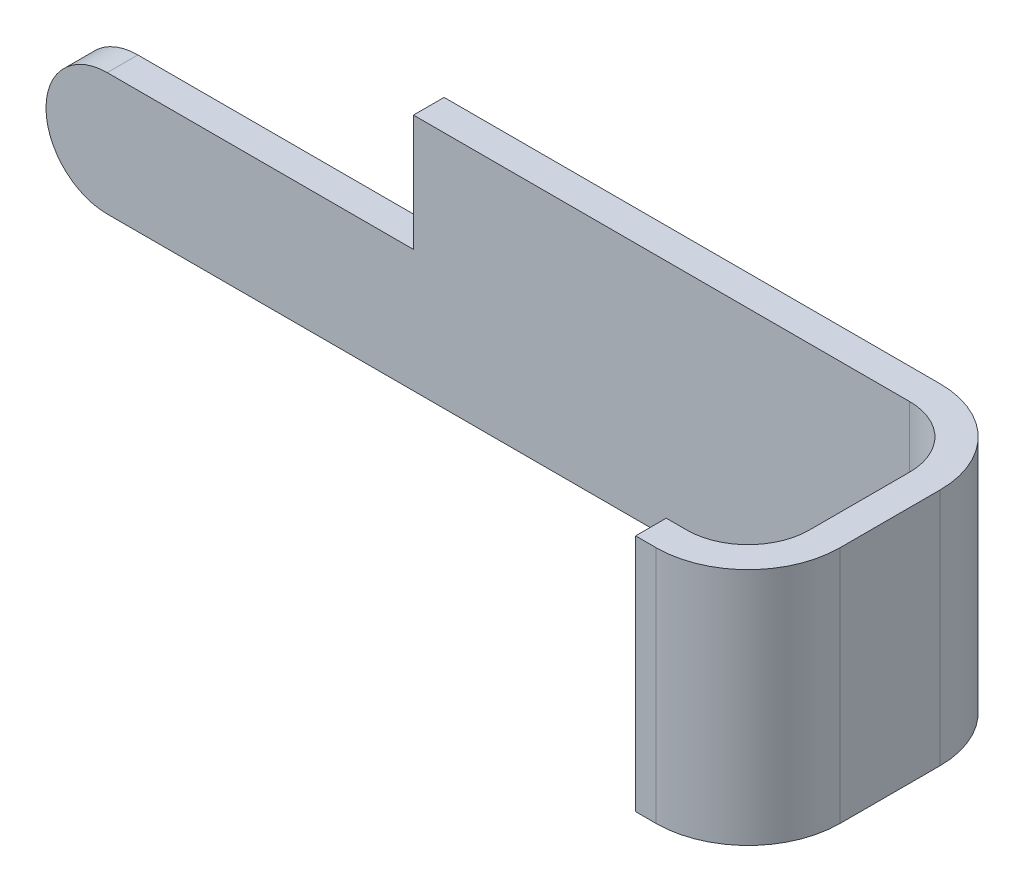
ISO-10303-21;
HEADER;
FILE_DESCRIPTION(('STEP AP214'),'2;1');
FILE_NAME('part.step','',(''),(''),'','','');
FILE_SCHEMA(('AUTOMOTIVE_DESIGN { 1 0 10303 214 1 1 1 1 }'));
ENDSEC;
DATA;
#1=APPLICATION_CONTEXT('core data for automotive mechanical design processes');
#2=APPLICATION_PROTOCOL_DEFINITION('international standard','automotive_design',2000,#1);
#3=PRODUCT_CONTEXT('',#1,'mechanical');
#4=PRODUCT('Part','Part','',(#3));
#5=PRODUCT_RELATED_PRODUCT_CATEGORY('part','',(#4));
#6=PRODUCT_DEFINITION_FORMATION('','',#4);
#7=PRODUCT_DEFINITION_CONTEXT('part definition',#1,'design');
#8=PRODUCT_DEFINITION('design','',#6,#7);
#9=PRODUCT_DEFINITION_SHAPE('','',#8);
#10=(LENGTH_UNIT() NAMED_UNIT(*) SI_UNIT(.MILLI.,.METRE.));
#11=(NAMED_UNIT(*) PLANE_ANGLE_UNIT() SI_UNIT($,.RADIAN.));
#12=(NAMED_UNIT(*) SI_UNIT($,.STERADIAN.) SOLID_ANGLE_UNIT());
#13=UNCERTAINTY_MEASURE_WITH_UNIT(LENGTH_MEASURE(1.E-05),#10,'distance_accuracy_value','');
#14=(GEOMETRIC_REPRESENTATION_CONTEXT(3) GLOBAL_UNCERTAINTY_ASSIGNED_CONTEXT((#13)) GLOBAL_UNIT_ASSIGNED_CONTEXT((#10,
#11,#12)) REPRESENTATION_CONTEXT('',''));
#15=CARTESIAN_POINT('',(0.,0.,0.));
#16=DIRECTION('',(0.,0.,1.));
#17=DIRECTION('',(1.,0.,0.));
#18=AXIS2_PLACEMENT_3D('',#15,#16,#17);
#19=CARTESIAN_POINT('',(6.56398601398603,0.,2.06825229575314));
#20=DIRECTION('',(1.,0.,0.));
#21=DIRECTION('',(0.,1.,0.));
#22=AXIS2_PLACEMENT_3D('',#19,#20,#21);
#23=PLANE('',#22);
#24=DIRECTION('',(0.,0.,-1.));
#25=VECTOR('',#24,1.);
#26=CARTESIAN_POINT('',(6.56398601398603,1.95,2.06825229575314));
#27=LINE('',#26,#25);
#28=CARTESIAN_POINT('',(6.56398601398603,1.95,1.31825229575319));
#29=VERTEX_POINT('',#28);
#30=CARTESIAN_POINT('',(6.56398601398603,1.95,0.500000000000051));
#31=VERTEX_POINT('',#30);
#32=EDGE_CURVE('E171',#29,#31,#27,.T.);
#33=ORIENTED_EDGE('',*,*,#32,.T.);
#34=DIRECTION('',(0.,-1.,0.));
#35=VECTOR('',#34,1.);
#36=CARTESIAN_POINT('',(6.56398601398603,0.,0.500000000000051));
#37=LINE('',#36,#35);
#38=CARTESIAN_POINT('',(6.56398601398603,0.,0.500000000000051));
#39=VERTEX_POINT('',#38);
#40=EDGE_CURVE('E218',#31,#39,#37,.T.);
#41=ORIENTED_EDGE('',*,*,#40,.T.);
#42=DIRECTION('',(0.,0.,-1.));
#43=VECTOR('',#42,1.);
#44=CARTESIAN_POINT('',(6.56398601398603,0.,2.06825229575314));
#45=LINE('',#44,#43);
#46=CARTESIAN_POINT('',(6.56398601398603,0.,1.31825229575319));
#47=VERTEX_POINT('',#46);
#48=EDGE_CURVE('E174',#47,#39,#45,.T.);
#49=ORIENTED_EDGE('',*,*,#48,.F.);
#50=DIRECTION('',(0.,-1.,0.));
#51=VECTOR('',#50,1.);
#52=CARTESIAN_POINT('',(6.56398601398603,1.95,1.31825229575319));
#53=LINE('',#52,#51);
#54=EDGE_CURVE('E213',#47,#29,#53,.F.);
#55=ORIENTED_EDGE('',*,*,#54,.T.);
#56=EDGE_LOOP('',(#33,#41,#49,#55));
#57=FACE_BOUND('',#56,.T.);
#58=ADVANCED_FACE('F32',(#57),#23,.F.);
#59=CARTESIAN_POINT('',(-0.486013986013983,0.5,0.));
#60=DIRECTION('',(0.,0.,-1.));
#61=DIRECTION('',(-1.,0.,0.));
#62=AXIS2_PLACEMENT_3D('',#59,#60,#61);
#63=PLANE('',#62);
#64=DIRECTION('',(-1.,0.,0.));
#65=VECTOR('',#64,1.);
#66=CARTESIAN_POINT('',(6.81398601398602,0.,0.));
#67=LINE('',#66,#65);
#68=CARTESIAN_POINT('',(6.06398601398603,0.,0.));
#69=VERTEX_POINT('',#68);
#70=CARTESIAN_POINT('',(-0.486013986013983,0.,0.));
#71=VERTEX_POINT('',#70);
#72=EDGE_CURVE('E201',#69,#71,#67,.T.);
#73=ORIENTED_EDGE('',*,*,#72,.F.);
#74=DIRECTION('',(0.,-1.,0.));
#75=VECTOR('',#74,1.);
#76=CARTESIAN_POINT('',(6.06398601398603,1.95,0.));
#77=LINE('',#76,#75);
#78=CARTESIAN_POINT('',(6.06398601398603,1.95,0.));
#79=VERTEX_POINT('',#78);
#80=EDGE_CURVE('E221',#69,#79,#77,.F.);
#81=ORIENTED_EDGE('',*,*,#80,.T.);
#82=DIRECTION('',(1.,0.,0.));
#83=VECTOR('',#82,1.);
#84=CARTESIAN_POINT('',(6.81398601398603,1.95,0.));
#85=LINE('',#84,#83);
#86=CARTESIAN_POINT('',(2.01398601398602,1.95,0.));
#87=VERTEX_POINT('',#86);
#88=EDGE_CURVE('E184',#87,#79,#85,.T.);
#89=ORIENTED_EDGE('',*,*,#88,.F.);
#90=DIRECTION('',(0.,-1.,0.));
#91=VECTOR('',#90,1.);
#92=CARTESIAN_POINT('',(2.01398601398602,1.95,0.));
#93=LINE('',#92,#91);
#94=CARTESIAN_POINT('',(2.01398601398602,1.,0.));
#95=VERTEX_POINT('',#94);
#96=EDGE_CURVE('E187',#87,#95,#93,.T.);
#97=ORIENTED_EDGE('',*,*,#96,.T.);
#98=DIRECTION('',(1.,0.,0.));
#99=VECTOR('',#98,1.);
#100=CARTESIAN_POINT('',(-0.486013986013984,1.,0.));
#101=LINE('',#100,#99);
#102=CARTESIAN_POINT('',(-0.486013986013984,1.,0.));
#103=VERTEX_POINT('',#102);
#104=EDGE_CURVE('E197',#103,#95,#101,.T.);
#105=ORIENTED_EDGE('',*,*,#104,.F.);
#106=CARTESIAN_POINT('',(-0.486013986013983,0.5,0.));
#107=DIRECTION('',(0.,0.,-1.));
#108=DIRECTION('',(-1.,0.,0.));
#109=AXIS2_PLACEMENT_3D('',#106,#107,#108);
#110=CIRCLE('',#109,0.5);
#111=EDGE_CURVE('E194',#71,#103,#110,.T.);
#112=ORIENTED_EDGE('',*,*,#111,.F.);
#113=EDGE_LOOP('',(#73,#81,#89,#97,#105,#112));
#114=FACE_BOUND('',#113,.T.);
#115=ADVANCED_FACE('F276',(#114),#63,.F.);
#116=CARTESIAN_POINT('',(-0.486013986013984,1.,0.));
#117=DIRECTION('',(0.,1.,0.));
#118=DIRECTION('',(0.,0.,1.));
#119=AXIS2_PLACEMENT_3D('',#116,#117,#118);
#120=PLANE('',#119);
#121=ORIENTED_EDGE('',*,*,#104,.T.);
#122=DIRECTION('',(0.,0.,1.));
#123=VECTOR('',#122,1.);
#124=CARTESIAN_POINT('',(2.01398601398602,1.,0.));
#125=LINE('',#124,#123);
#126=CARTESIAN_POINT('',(2.01398601398602,1.,-0.25));
#127=VERTEX_POINT('',#126);
#128=EDGE_CURVE('E177',#127,#95,#125,.T.);
#129=ORIENTED_EDGE('',*,*,#128,.F.);
#130=DIRECTION('',(1.,0.,0.));
#131=VECTOR('',#130,1.);
#132=CARTESIAN_POINT('',(-0.486013986013984,1.,-0.25));
#133=LINE('',#132,#131);
#134=CARTESIAN_POINT('',(-0.486013986013984,1.,-0.25));
#135=VERTEX_POINT('',#134);
#136=EDGE_CURVE('E206',#135,#127,#133,.T.);
#137=ORIENTED_EDGE('',*,*,#136,.F.);
#138=DIRECTION('',(0.,0.,-1.));
#139=VECTOR('',#138,1.);
#140=CARTESIAN_POINT('',(-0.486013986013984,1.,0.));
#141=LINE('',#140,#139);
#142=EDGE_CURVE('E203',#103,#135,#141,.T.);
#143=ORIENTED_EDGE('',*,*,#142,.F.);
#144=EDGE_LOOP('',(#121,#129,#137,#143));
#145=FACE_BOUND('',#144,.T.);
#146=ADVANCED_FACE('F281',(#145),#120,.T.);
#147=CARTESIAN_POINT('',(-0.486013986013983,0.5,0.));
#148=DIRECTION('',(0.,0.,-1.));
#149=DIRECTION('',(-1.,0.,0.));
#150=AXIS2_PLACEMENT_3D('',#147,#148,#149);
#151=CYLINDRICAL_SURFACE('',#150,0.5);
#152=CARTESIAN_POINT('',(-0.486013986013983,0.5,-0.25));
#153=DIRECTION('',(0.,0.,-1.));
#154=DIRECTION('',(-1.,0.,0.));
#155=AXIS2_PLACEMENT_3D('',#152,#153,#154);
#156=CIRCLE('',#155,0.5);
#157=CARTESIAN_POINT('',(-0.486013986013983,0.,-0.25));
#158=VERTEX_POINT('',#157);
#159=EDGE_CURVE('E193',#158,#135,#156,.T.);
#160=ORIENTED_EDGE('',*,*,#159,.F.);
#161=DIRECTION('',(0.,0.,-1.));
#162=VECTOR('',#161,1.);
#163=CARTESIAN_POINT('',(-0.486013986013983,0.,0.));
#164=LINE('',#163,#162);
#165=EDGE_CURVE('E210',#71,#158,#164,.T.);
#166=ORIENTED_EDGE('',*,*,#165,.F.);
#167=ORIENTED_EDGE('',*,*,#111,.T.);
#168=ORIENTED_EDGE('',*,*,#142,.T.);
#169=EDGE_LOOP('',(#160,#166,#167,#168));
#170=FACE_BOUND('',#169,.T.);
#171=ADVANCED_FACE('F297',(#170),#151,.T.);
#172=CARTESIAN_POINT('',(6.81398601398602,0.,0.));
#173=DIRECTION('',(0.,-1.,0.));
#174=DIRECTION('',(1.,0.,0.));
#175=AXIS2_PLACEMENT_3D('',#172,#173,#174);
#176=PLANE('',#175);
#177=DIRECTION('',(-1.,0.,0.));
#178=VECTOR('',#177,1.);
#179=CARTESIAN_POINT('',(6.81398601398602,0.,-0.25));
#180=LINE('',#179,#178);
#181=CARTESIAN_POINT('',(6.06398601398602,0.,-0.25));
#182=VERTEX_POINT('',#181);
#183=EDGE_CURVE('E198',#182,#158,#180,.T.);
#184=ORIENTED_EDGE('',*,*,#183,.F.);
#185=CARTESIAN_POINT('',(6.06398601398602,0.,0.5));
#186=DIRECTION('',(0.,-1.,0.));
#187=DIRECTION('',(1.,0.,0.));
#188=AXIS2_PLACEMENT_3D('',#185,#186,#187);
#189=CIRCLE('',#188,0.75);
#190=CARTESIAN_POINT('',(6.81398601398602,0.,0.5));
#191=VERTEX_POINT('',#190);
#192=EDGE_CURVE('E237',#182,#191,#189,.T.);
#193=ORIENTED_EDGE('',*,*,#192,.T.);
#194=DIRECTION('',(0.,0.,-1.));
#195=VECTOR('',#194,1.);
#196=CARTESIAN_POINT('',(6.81398601398602,0.,0.));
#197=LINE('',#196,#195);
#198=CARTESIAN_POINT('',(6.81398601398602,0.,1.31825229575314));
#199=VERTEX_POINT('',#198);
#200=EDGE_CURVE('E214',#199,#191,#197,.T.);
#201=ORIENTED_EDGE('',*,*,#200,.F.);
#202=CARTESIAN_POINT('',(6.06398601398602,0.,1.31825229575314));
#203=DIRECTION('',(0.,-1.,0.));
#204=DIRECTION('',(1.,0.,0.));
#205=AXIS2_PLACEMENT_3D('',#202,#203,#204);
#206=CIRCLE('',#205,0.75);
#207=CARTESIAN_POINT('',(6.06398601398602,0.,2.06825229575314));
#208=VERTEX_POINT('',#207);
#209=EDGE_CURVE('E235',#199,#208,#206,.T.);
#210=ORIENTED_EDGE('',*,*,#209,.T.);
#211=DIRECTION('',(1.,0.,0.));
#212=VECTOR('',#211,1.);
#213=CARTESIAN_POINT('',(6.81398601398603,0.,2.06825229575314));
#214=LINE('',#213,#212);
#215=CARTESIAN_POINT('',(5.89573371823284,0.,2.06825229575319));
#216=VERTEX_POINT('',#215);
#217=EDGE_CURVE('E162',#216,#208,#214,.T.);
#218=ORIENTED_EDGE('',*,*,#217,.F.);
#219=DIRECTION('',(0.,0.,1.));
#220=VECTOR('',#219,1.);
#221=CARTESIAN_POINT('',(5.89573371823284,0.,2.06825229575319));
#222=LINE('',#221,#220);
#223=CARTESIAN_POINT('',(5.89573371823284,0.,1.81825229575319));
#224=VERTEX_POINT('',#223);
#225=EDGE_CURVE('E147',#224,#216,#222,.T.);
#226=ORIENTED_EDGE('',*,*,#225,.F.);
#227=DIRECTION('',(1.,0.,0.));
#228=VECTOR('',#227,1.);
#229=CARTESIAN_POINT('',(5.89573371823284,0.,1.81825229575319));
#230=LINE('',#229,#228);
#231=CARTESIAN_POINT('',(6.06398601398603,0.,1.81825229575319));
#232=VERTEX_POINT('',#231);
#233=EDGE_CURVE('E143',#224,#232,#230,.T.);
#234=ORIENTED_EDGE('',*,*,#233,.T.);
#235=CARTESIAN_POINT('',(6.06398601398603,0.,1.31825229575319));
#236=DIRECTION('',(0.,-1.,0.));
#237=DIRECTION('',(1.,0.,0.));
#238=AXIS2_PLACEMENT_3D('',#235,#236,#237);
#239=CIRCLE('',#238,0.5);
#240=EDGE_CURVE('E229',#232,#47,#239,.F.);
#241=ORIENTED_EDGE('',*,*,#240,.T.);
#242=ORIENTED_EDGE('',*,*,#48,.T.);
#243=CARTESIAN_POINT('',(6.06398601398603,0.,0.500000000000051));
#244=DIRECTION('',(0.,-1.,0.));
#245=DIRECTION('',(1.,0.,0.));
#246=AXIS2_PLACEMENT_3D('',#243,#244,#245);
#247=CIRCLE('',#246,0.5);
#248=EDGE_CURVE('E225',#39,#69,#247,.F.);
#249=ORIENTED_EDGE('',*,*,#248,.T.);
#250=ORIENTED_EDGE('',*,*,#72,.T.);
#251=ORIENTED_EDGE('',*,*,#165,.T.);
#252=EDGE_LOOP('',(#184,#193,#201,#210,#218,#226,#234,#241,#242,#249,#250,#251));
#253=FACE_BOUND('',#252,.T.);
#254=ADVANCED_FACE('F254',(#253),#176,.T.);
#255=CARTESIAN_POINT('',(6.81398601398602,1.,0.));
#256=DIRECTION('',(1.,0.,0.));
#257=DIRECTION('',(0.,0.,-1.));
#258=AXIS2_PLACEMENT_3D('',#255,#256,#257);
#259=PLANE('',#258);
#260=ORIENTED_EDGE('',*,*,#200,.T.);
#261=DIRECTION('',(0.,-1.,0.));
#262=VECTOR('',#261,1.);
#263=CARTESIAN_POINT('',(6.81398601398602,1.,0.5));
#264=LINE('',#263,#262);
#265=CARTESIAN_POINT('',(6.81398601398604,1.95,0.5));
#266=VERTEX_POINT('',#265);
#267=EDGE_CURVE('E54',#191,#266,#264,.F.);
#268=ORIENTED_EDGE('',*,*,#267,.T.);
#269=DIRECTION('',(0.,0.,-1.));
#270=VECTOR('',#269,1.);
#271=CARTESIAN_POINT('',(6.81398601398602,1.95,-0.25));
#272=LINE('',#271,#270);
#273=CARTESIAN_POINT('',(6.81398601398607,1.95,1.31825229575314));
#274=VERTEX_POINT('',#273);
#275=EDGE_CURVE('E178',#274,#266,#272,.T.);
#276=ORIENTED_EDGE('',*,*,#275,.F.);
#277=DIRECTION('',(0.,1.,0.));
#278=VECTOR('',#277,1.);
#279=CARTESIAN_POINT('',(6.81398601398602,0.,1.31825229575314));
#280=LINE('',#279,#278);
#281=EDGE_CURVE('E239',#274,#199,#280,.F.);
#282=ORIENTED_EDGE('',*,*,#281,.T.);
#283=EDGE_LOOP('',(#260,#268,#276,#282));
#284=FACE_BOUND('',#283,.T.);
#285=ADVANCED_FACE('F256',(#284),#259,.T.);
#286=CARTESIAN_POINT('',(-0.486013986013983,0.5,-0.25));
#287=DIRECTION('',(0.,0.,-1.));
#288=DIRECTION('',(-1.,0.,0.));
#289=AXIS2_PLACEMENT_3D('',#286,#287,#288);
#290=PLANE('',#289);
#291=DIRECTION('',(-1.,0.,0.));
#292=VECTOR('',#291,1.);
#293=CARTESIAN_POINT('',(2.01398601398602,1.95,-0.25));
#294=LINE('',#293,#292);
#295=CARTESIAN_POINT('',(6.06398601398602,1.95,-0.25));
#296=VERTEX_POINT('',#295);
#297=CARTESIAN_POINT('',(2.01398601398602,1.95,-0.25));
#298=VERTEX_POINT('',#297);
#299=EDGE_CURVE('E180',#296,#298,#294,.T.);
#300=ORIENTED_EDGE('',*,*,#299,.F.);
#301=DIRECTION('',(0.,-1.,0.));
#302=VECTOR('',#301,1.);
#303=CARTESIAN_POINT('',(6.06398601398602,0.5,-0.25));
#304=LINE('',#303,#302);
#305=EDGE_CURVE('E232',#296,#182,#304,.T.);
#306=ORIENTED_EDGE('',*,*,#305,.T.);
#307=ORIENTED_EDGE('',*,*,#183,.T.);
#308=ORIENTED_EDGE('',*,*,#159,.T.);
#309=ORIENTED_EDGE('',*,*,#136,.T.);
#310=DIRECTION('',(0.,-1.,0.));
#311=VECTOR('',#310,1.);
#312=CARTESIAN_POINT('',(2.01398601398602,1.95,-0.25));
#313=LINE('',#312,#311);
#314=EDGE_CURVE('E191',#298,#127,#313,.T.);
#315=ORIENTED_EDGE('',*,*,#314,.F.);
#316=EDGE_LOOP('',(#300,#306,#307,#308,#309,#315));
#317=FACE_BOUND('',#316,.T.);
#318=ADVANCED_FACE('F248',(#317),#290,.T.);
#319=CARTESIAN_POINT('',(2.01398601398602,1.95,0.));
#320=DIRECTION('',(1.,0.,0.));
#321=DIRECTION('',(0.,0.,-1.));
#322=AXIS2_PLACEMENT_3D('',#319,#320,#321);
#323=PLANE('',#322);
#324=ORIENTED_EDGE('',*,*,#128,.T.);
#325=ORIENTED_EDGE('',*,*,#96,.F.);
#326=DIRECTION('',(0.,0.,1.));
#327=VECTOR('',#326,1.);
#328=CARTESIAN_POINT('',(2.01398601398602,1.95,0.));
#329=LINE('',#328,#327);
#330=EDGE_CURVE('E182',#298,#87,#329,.T.);
#331=ORIENTED_EDGE('',*,*,#330,.F.);
#332=ORIENTED_EDGE('',*,*,#314,.T.);
#333=EDGE_LOOP('',(#324,#325,#331,#332));
#334=FACE_BOUND('',#333,.T.);
#335=ADVANCED_FACE('F289',(#334),#323,.F.);
#336=CARTESIAN_POINT('',(0.,1.95,0.));
#337=DIRECTION('',(0.,-1.,0.));
#338=DIRECTION('',(0.,0.,-1.));
#339=AXIS2_PLACEMENT_3D('',#336,#337,#338);
#340=PLANE('',#339);
#341=ORIENTED_EDGE('',*,*,#275,.T.);
#342=CARTESIAN_POINT('',(6.06398601398602,1.95,0.5));
#343=DIRECTION('',(0.,-1.,0.));
#344=DIRECTION('',(0.,0.,-1.));
#345=AXIS2_PLACEMENT_3D('',#342,#343,#344);
#346=CIRCLE('',#345,0.75);
#347=EDGE_CURVE('E40',#266,#296,#346,.F.);
#348=ORIENTED_EDGE('',*,*,#347,.T.);
#349=ORIENTED_EDGE('',*,*,#299,.T.);
#350=ORIENTED_EDGE('',*,*,#330,.T.);
#351=ORIENTED_EDGE('',*,*,#88,.T.);
#352=CARTESIAN_POINT('',(6.06398601398603,1.95,0.500000000000051));
#353=DIRECTION('',(0.,-1.,0.));
#354=DIRECTION('',(0.,0.,-1.));
#355=AXIS2_PLACEMENT_3D('',#352,#353,#354);
#356=CIRCLE('',#355,0.5);
#357=EDGE_CURVE('E227',#79,#31,#356,.T.);
#358=ORIENTED_EDGE('',*,*,#357,.T.);
#359=ORIENTED_EDGE('',*,*,#32,.F.);
#360=CARTESIAN_POINT('',(6.06398601398603,1.95,1.31825229575319));
#361=DIRECTION('',(0.,-1.,0.));
#362=DIRECTION('',(0.,0.,-1.));
#363=AXIS2_PLACEMENT_3D('',#360,#361,#362);
#364=CIRCLE('',#363,0.5);
#365=CARTESIAN_POINT('',(6.06398601398603,1.95,1.81825229575319));
#366=VERTEX_POINT('',#365);
#367=EDGE_CURVE('E161',#29,#366,#364,.T.);
#368=ORIENTED_EDGE('',*,*,#367,.T.);
#369=DIRECTION('',(1.,0.,0.));
#370=VECTOR('',#369,1.);
#371=CARTESIAN_POINT('',(5.89573371823284,1.95,1.81825229575319));
#372=LINE('',#371,#370);
#373=CARTESIAN_POINT('',(5.89573371823284,1.95,1.81825229575319));
#374=VERTEX_POINT('',#373);
#375=EDGE_CURVE('E140',#374,#366,#372,.T.);
#376=ORIENTED_EDGE('',*,*,#375,.F.);
#377=DIRECTION('',(0.,0.,-1.));
#378=VECTOR('',#377,1.);
#379=CARTESIAN_POINT('',(5.89573371823284,1.95,1.81825229575319));
#380=LINE('',#379,#378);
#381=CARTESIAN_POINT('',(5.89573371823284,1.95,2.06825229575319));
#382=VERTEX_POINT('',#381);
#383=EDGE_CURVE('E148',#382,#374,#380,.T.);
#384=ORIENTED_EDGE('',*,*,#383,.F.);
#385=DIRECTION('',(-1.,0.,0.));
#386=VECTOR('',#385,1.);
#387=CARTESIAN_POINT('',(6.56398601398603,1.95,2.06825229575314));
#388=LINE('',#387,#386);
#389=CARTESIAN_POINT('',(6.06398601398602,1.95,2.06825229575314));
#390=VERTEX_POINT('',#389);
#391=EDGE_CURVE('E165',#390,#382,#388,.T.);
#392=ORIENTED_EDGE('',*,*,#391,.F.);
#393=CARTESIAN_POINT('',(6.06398601398602,1.95,1.31825229575314));
#394=DIRECTION('',(0.,-1.,0.));
#395=DIRECTION('',(0.,0.,-1.));
#396=AXIS2_PLACEMENT_3D('',#393,#394,#395);
#397=CIRCLE('',#396,0.75);
#398=EDGE_CURVE('E47',#390,#274,#397,.F.);
#399=ORIENTED_EDGE('',*,*,#398,.T.);
#400=EDGE_LOOP('',(#341,#348,#349,#350,#351,#358,#359,#368,#376,#384,#392,#399));
#401=FACE_BOUND('',#400,.T.);
#402=ADVANCED_FACE('F158',(#401),#340,.F.);
#403=CARTESIAN_POINT('',(0.,0.,2.06825229575314));
#404=DIRECTION('',(0.,0.,-1.));
#405=DIRECTION('',(-1.,0.,0.));
#406=AXIS2_PLACEMENT_3D('',#403,#404,#405);
#407=PLANE('',#406);
#408=ORIENTED_EDGE('',*,*,#217,.T.);
#409=DIRECTION('',(0.,1.,0.));
#410=VECTOR('',#409,1.);
#411=CARTESIAN_POINT('',(6.06398601398602,1.95,2.06825229575314));
#412=LINE('',#411,#410);
#413=EDGE_CURVE('E11',#208,#390,#412,.T.);
#414=ORIENTED_EDGE('',*,*,#413,.T.);
#415=ORIENTED_EDGE('',*,*,#391,.T.);
#416=DIRECTION('',(0.,1.,0.));
#417=VECTOR('',#416,1.);
#418=CARTESIAN_POINT('',(5.89573371823284,1.95,2.06825229575319));
#419=LINE('',#418,#417);
#420=EDGE_CURVE('E154',#216,#382,#419,.T.);
#421=ORIENTED_EDGE('',*,*,#420,.F.);
#422=EDGE_LOOP('',(#408,#414,#415,#421));
#423=FACE_BOUND('',#422,.T.);
#424=ADVANCED_FACE('F258',(#423),#407,.F.);
#425=CARTESIAN_POINT('',(5.89573371823284,0.,1.81825229575319));
#426=DIRECTION('',(0.,0.,1.));
#427=DIRECTION('',(1.,0.,0.));
#428=AXIS2_PLACEMENT_3D('',#425,#426,#427);
#429=PLANE('',#428);
#430=ORIENTED_EDGE('',*,*,#375,.T.);
#431=DIRECTION('',(0.,-1.,0.));
#432=VECTOR('',#431,1.);
#433=CARTESIAN_POINT('',(6.06398601398603,0.,1.81825229575319));
#434=LINE('',#433,#432);
#435=EDGE_CURVE('E223',#366,#232,#434,.T.);
#436=ORIENTED_EDGE('',*,*,#435,.T.);
#437=ORIENTED_EDGE('',*,*,#233,.F.);
#438=DIRECTION('',(0.,-1.,0.));
#439=VECTOR('',#438,1.);
#440=CARTESIAN_POINT('',(5.89573371823284,0.,1.81825229575319));
#441=LINE('',#440,#439);
#442=EDGE_CURVE('E135',#374,#224,#441,.T.);
#443=ORIENTED_EDGE('',*,*,#442,.F.);
#444=EDGE_LOOP('',(#430,#436,#437,#443));
#445=FACE_BOUND('',#444,.T.);
#446=ADVANCED_FACE('F137',(#445),#429,.F.);
#447=CARTESIAN_POINT('',(5.89573371823284,0.,0.));
#448=DIRECTION('',(1.,0.,0.));
#449=DIRECTION('',(0.,1.,0.));
#450=AXIS2_PLACEMENT_3D('',#447,#448,#449);
#451=PLANE('',#450);
#452=ORIENTED_EDGE('',*,*,#383,.T.);
#453=ORIENTED_EDGE('',*,*,#442,.T.);
#454=ORIENTED_EDGE('',*,*,#225,.T.);
#455=ORIENTED_EDGE('',*,*,#420,.T.);
#456=EDGE_LOOP('',(#452,#453,#454,#455));
#457=FACE_BOUND('',#456,.T.);
#458=ADVANCED_FACE('F152',(#457),#451,.F.);
#459=CARTESIAN_POINT('',(6.06398601398603,0.,0.500000000000051));
#460=DIRECTION('',(0.,1.,0.));
#461=DIRECTION('',(-1.,0.,0.));
#462=AXIS2_PLACEMENT_3D('',#459,#460,#461);
#463=CYLINDRICAL_SURFACE('',#462,0.5);
#464=ORIENTED_EDGE('',*,*,#357,.F.);
#465=ORIENTED_EDGE('',*,*,#80,.F.);
#466=ORIENTED_EDGE('',*,*,#248,.F.);
#467=ORIENTED_EDGE('',*,*,#40,.F.);
#468=EDGE_LOOP('',(#464,#465,#466,#467));
#469=FACE_BOUND('',#468,.T.);
#470=ADVANCED_FACE('F267',(#469),#463,.F.);
#471=CARTESIAN_POINT('',(6.06398601398603,0.,1.31825229575319));
#472=DIRECTION('',(0.,1.,0.));
#473=DIRECTION('',(-1.,0.,0.));
#474=AXIS2_PLACEMENT_3D('',#471,#472,#473);
#475=CYLINDRICAL_SURFACE('',#474,0.5);
#476=ORIENTED_EDGE('',*,*,#367,.F.);
#477=ORIENTED_EDGE('',*,*,#54,.F.);
#478=ORIENTED_EDGE('',*,*,#240,.F.);
#479=ORIENTED_EDGE('',*,*,#435,.F.);
#480=EDGE_LOOP('',(#476,#477,#478,#479));
#481=FACE_BOUND('',#480,.T.);
#482=ADVANCED_FACE('F265',(#481),#475,.F.);
#483=CARTESIAN_POINT('',(6.06398601398602,0.5,0.5));
#484=DIRECTION('',(0.,-1.,0.));
#485=DIRECTION('',(0.,0.,-1.));
#486=AXIS2_PLACEMENT_3D('',#483,#484,#485);
#487=CYLINDRICAL_SURFACE('',#486,0.75);
#488=ORIENTED_EDGE('',*,*,#347,.F.);
#489=ORIENTED_EDGE('',*,*,#267,.F.);
#490=ORIENTED_EDGE('',*,*,#192,.F.);
#491=ORIENTED_EDGE('',*,*,#305,.F.);
#492=EDGE_LOOP('',(#488,#489,#490,#491));
#493=FACE_BOUND('',#492,.T.);
#494=ADVANCED_FACE('F251',(#493),#487,.T.);
#495=CARTESIAN_POINT('',(6.06398601398602,0.,1.31825229575314));
#496=DIRECTION('',(0.,-1.,0.));
#497=DIRECTION('',(0.,0.,-1.));
#498=AXIS2_PLACEMENT_3D('',#495,#496,#497);
#499=CYLINDRICAL_SURFACE('',#498,0.75);
#500=ORIENTED_EDGE('',*,*,#209,.F.);
#501=ORIENTED_EDGE('',*,*,#281,.F.);
#502=ORIENTED_EDGE('',*,*,#398,.F.);
#503=ORIENTED_EDGE('',*,*,#413,.F.);
#504=EDGE_LOOP('',(#500,#501,#502,#503));
#505=FACE_BOUND('',#504,.T.);
#506=ADVANCED_FACE('F34',(#505),#499,.T.);
#507=CLOSED_SHELL('',(#58,#115,#146,#171,#254,#285,#318,#335,#402,#424,#446,#458,#470,#482,#494,#506));
#508=MANIFOLD_SOLID_BREP('B2',#507);
#509=ADVANCED_BREP_SHAPE_REPRESENTATION('',(#18,#508),#14);
#510=SHAPE_DEFINITION_REPRESENTATION(#9,#509);
ENDSEC;
END-ISO-10303-21;
